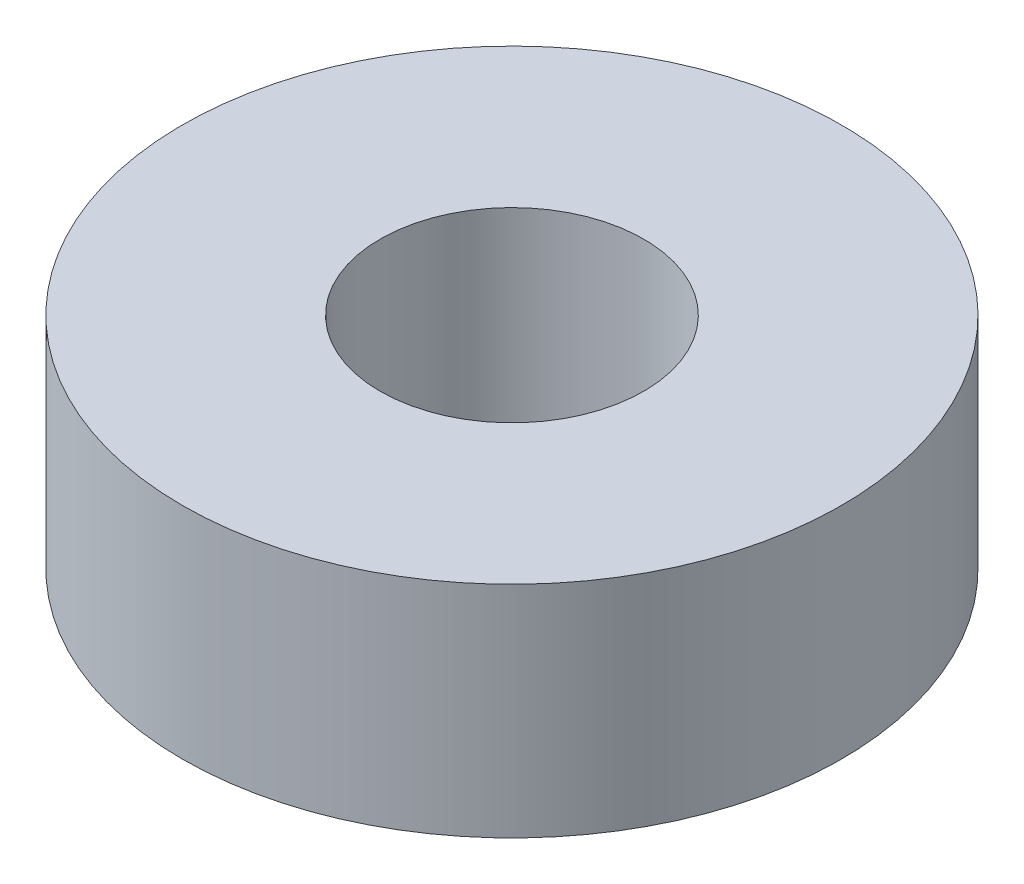
ISO-10303-21;
HEADER;
FILE_DESCRIPTION(('STEP AP214'),'2;1');
FILE_NAME('part.step','',(''),(''),'','','');
FILE_SCHEMA(('AUTOMOTIVE_DESIGN { 1 0 10303 214 1 1 1 1 }'));
ENDSEC;
DATA;
#1=APPLICATION_CONTEXT('core data for automotive mechanical design processes');
#2=APPLICATION_PROTOCOL_DEFINITION('international standard','automotive_design',2000,#1);
#3=PRODUCT_CONTEXT('',#1,'mechanical');
#4=PRODUCT('Part','Part','',(#3));
#5=PRODUCT_RELATED_PRODUCT_CATEGORY('part','',(#4));
#6=PRODUCT_DEFINITION_FORMATION('','',#4);
#7=PRODUCT_DEFINITION_CONTEXT('part definition',#1,'design');
#8=PRODUCT_DEFINITION('design','',#6,#7);
#9=PRODUCT_DEFINITION_SHAPE('','',#8);
#10=(LENGTH_UNIT() NAMED_UNIT(*) SI_UNIT(.MILLI.,.METRE.));
#11=(NAMED_UNIT(*) PLANE_ANGLE_UNIT() SI_UNIT($,.RADIAN.));
#12=(NAMED_UNIT(*) SI_UNIT($,.STERADIAN.) SOLID_ANGLE_UNIT());
#13=UNCERTAINTY_MEASURE_WITH_UNIT(LENGTH_MEASURE(1.E-05),#10,'distance_accuracy_value','');
#14=(GEOMETRIC_REPRESENTATION_CONTEXT(3) GLOBAL_UNCERTAINTY_ASSIGNED_CONTEXT((#13)) GLOBAL_UNIT_ASSIGNED_CONTEXT((#10,
#11,#12)) REPRESENTATION_CONTEXT('',''));
#15=CARTESIAN_POINT('',(0.,0.,0.));
#16=DIRECTION('',(0.,0.,1.));
#17=DIRECTION('',(1.,0.,0.));
#18=AXIS2_PLACEMENT_3D('',#15,#16,#17);
#19=CARTESIAN_POINT('',(0.,5.,0.));
#20=DIRECTION('',(0.,-1.,0.));
#21=DIRECTION('',(0.,0.,-1.));
#22=AXIS2_PLACEMENT_3D('',#19,#20,#21);
#23=CYLINDRICAL_SURFACE('',#22,7.5);
#24=CARTESIAN_POINT('',(0.,5.,0.));
#25=DIRECTION('',(0.,1.,0.));
#26=DIRECTION('',(0.,0.,1.));
#27=AXIS2_PLACEMENT_3D('',#24,#25,#26);
#28=CIRCLE('',#27,7.5);
#29=CARTESIAN_POINT('',(0.,5.,7.5));
#30=VERTEX_POINT('',#29);
#31=EDGE_CURVE('E10',#30,#30,#28,.T.);
#32=ORIENTED_EDGE('',*,*,#31,.F.);
#33=EDGE_LOOP('',(#32));
#34=FACE_BOUND('',#33,.T.);
#35=CARTESIAN_POINT('',(0.,0.,0.));
#36=DIRECTION('',(0.,1.,0.));
#37=DIRECTION('',(0.,0.,1.));
#38=AXIS2_PLACEMENT_3D('',#35,#36,#37);
#39=CIRCLE('',#38,7.5);
#40=CARTESIAN_POINT('',(0.,0.,7.5));
#41=VERTEX_POINT('',#40);
#42=EDGE_CURVE('E42',#41,#41,#39,.T.);
#43=ORIENTED_EDGE('',*,*,#42,.T.);
#44=EDGE_LOOP('',(#43));
#45=FACE_BOUND('',#44,.T.);
#46=ADVANCED_FACE('F39',(#34,#45),#23,.T.);
#47=CARTESIAN_POINT('',(0.,5.,0.));
#48=DIRECTION('',(0.,1.,0.));
#49=DIRECTION('',(0.,0.,1.));
#50=AXIS2_PLACEMENT_3D('',#47,#48,#49);
#51=PLANE('',#50);
#52=CARTESIAN_POINT('',(0.,5.,0.));
#53=DIRECTION('',(0.,1.,0.));
#54=DIRECTION('',(0.,0.,1.));
#55=AXIS2_PLACEMENT_3D('',#52,#53,#54);
#56=CIRCLE('',#55,3.);
#57=CARTESIAN_POINT('',(0.,5.,3.));
#58=VERTEX_POINT('',#57);
#59=EDGE_CURVE('E51',#58,#58,#56,.T.);
#60=ORIENTED_EDGE('',*,*,#59,.F.);
#61=EDGE_LOOP('',(#60));
#62=FACE_BOUND('',#61,.T.);
#63=ORIENTED_EDGE('',*,*,#31,.T.);
#64=EDGE_LOOP('',(#63));
#65=FACE_BOUND('',#64,.T.);
#66=ADVANCED_FACE('F70',(#62,#65),#51,.T.);
#67=CARTESIAN_POINT('',(0.,0.,0.));
#68=DIRECTION('',(0.,1.,0.));
#69=DIRECTION('',(0.,0.,1.));
#70=AXIS2_PLACEMENT_3D('',#67,#68,#69);
#71=PLANE('',#70);
#72=CARTESIAN_POINT('',(0.,0.,0.));
#73=DIRECTION('',(0.,1.,0.));
#74=DIRECTION('',(0.,0.,1.));
#75=AXIS2_PLACEMENT_3D('',#72,#73,#74);
#76=CIRCLE('',#75,3.);
#77=CARTESIAN_POINT('',(0.,0.,3.));
#78=VERTEX_POINT('',#77);
#79=EDGE_CURVE('E56',#78,#78,#76,.T.);
#80=ORIENTED_EDGE('',*,*,#79,.T.);
#81=EDGE_LOOP('',(#80));
#82=FACE_BOUND('',#81,.T.);
#83=ORIENTED_EDGE('',*,*,#42,.F.);
#84=EDGE_LOOP('',(#83));
#85=FACE_BOUND('',#84,.T.);
#86=ADVANCED_FACE('F61',(#82,#85),#71,.F.);
#87=CARTESIAN_POINT('',(0.,13.4852813742386,0.));
#88=DIRECTION('',(0.,-1.,0.));
#89=DIRECTION('',(0.,0.,-1.));
#90=AXIS2_PLACEMENT_3D('',#87,#88,#89);
#91=CYLINDRICAL_SURFACE('',#90,3.);
#92=ORIENTED_EDGE('',*,*,#79,.F.);
#93=EDGE_LOOP('',(#92));
#94=FACE_BOUND('',#93,.T.);
#95=ORIENTED_EDGE('',*,*,#59,.T.);
#96=EDGE_LOOP('',(#95));
#97=FACE_BOUND('',#96,.T.);
#98=ADVANCED_FACE('F64',(#94,#97),#91,.F.);
#99=CLOSED_SHELL('',(#46,#66,#86,#98));
#100=MANIFOLD_SOLID_BREP('B2',#99);
#101=ADVANCED_BREP_SHAPE_REPRESENTATION('',(#18,#100),#14);
#102=SHAPE_DEFINITION_REPRESENTATION(#9,#101);
ENDSEC;
END-ISO-10303-21;
